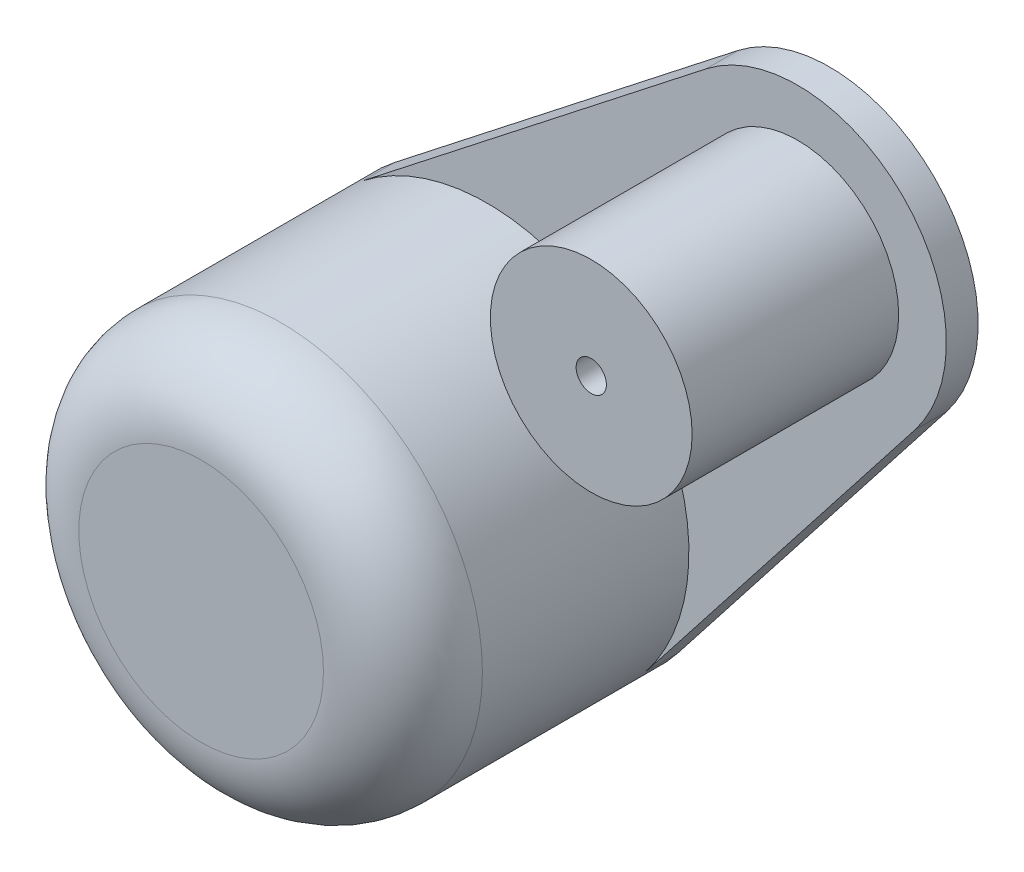
ISO-10303-21;
HEADER;
FILE_DESCRIPTION(('STEP AP214'),'2;1');
FILE_NAME('part.step','',(''),(''),'','','');
FILE_SCHEMA(('AUTOMOTIVE_DESIGN { 1 0 10303 214 1 1 1 1 }'));
ENDSEC;
DATA;
#1=APPLICATION_CONTEXT('core data for automotive mechanical design processes');
#2=APPLICATION_PROTOCOL_DEFINITION('international standard','automotive_design',2000,#1);
#3=PRODUCT_CONTEXT('',#1,'mechanical');
#4=PRODUCT('Part','Part','',(#3));
#5=PRODUCT_RELATED_PRODUCT_CATEGORY('part','',(#4));
#6=PRODUCT_DEFINITION_FORMATION('','',#4);
#7=PRODUCT_DEFINITION_CONTEXT('part definition',#1,'design');
#8=PRODUCT_DEFINITION('design','',#6,#7);
#9=PRODUCT_DEFINITION_SHAPE('','',#8);
#10=(LENGTH_UNIT() NAMED_UNIT(*) SI_UNIT(.MILLI.,.METRE.));
#11=(NAMED_UNIT(*) PLANE_ANGLE_UNIT() SI_UNIT($,.RADIAN.));
#12=(NAMED_UNIT(*) SI_UNIT($,.STERADIAN.) SOLID_ANGLE_UNIT());
#13=UNCERTAINTY_MEASURE_WITH_UNIT(LENGTH_MEASURE(1.E-05),#10,'distance_accuracy_value','');
#14=(GEOMETRIC_REPRESENTATION_CONTEXT(3) GLOBAL_UNCERTAINTY_ASSIGNED_CONTEXT((#13)) GLOBAL_UNIT_ASSIGNED_CONTEXT((#10,
#11,#12)) REPRESENTATION_CONTEXT('',''));
#15=CARTESIAN_POINT('',(0.,0.,0.));
#16=DIRECTION('',(0.,0.,1.));
#17=DIRECTION('',(1.,0.,0.));
#18=AXIS2_PLACEMENT_3D('',#15,#16,#17);
#19=CARTESIAN_POINT('',(0.,0.,20.));
#20=DIRECTION('',(0.,0.,-1.));
#21=DIRECTION('',(-1.,0.,0.));
#22=AXIS2_PLACEMENT_3D('',#19,#20,#21);
#23=CYLINDRICAL_SURFACE('',#22,12.7);
#24=CARTESIAN_POINT('',(0.,0.,2.));
#25=DIRECTION('',(0.,0.,-1.));
#26=DIRECTION('',(1.,0.,0.));
#27=AXIS2_PLACEMENT_3D('',#24,#25,#26);
#28=CIRCLE('',#27,12.7);
#29=CARTESIAN_POINT('',(-7.82607762735875,10.0021252226992,2.));
#30=VERTEX_POINT('',#29);
#31=CARTESIAN_POINT('',(10.0021252226992,-7.82607762735871,2.));
#32=VERTEX_POINT('',#31);
#33=EDGE_CURVE('E51',#30,#32,#28,.T.);
#34=ORIENTED_EDGE('',*,*,#33,.F.);
#35=DIRECTION('',(0.,0.,-1.));
#36=VECTOR('',#35,1.);
#37=CARTESIAN_POINT('',(-7.82607762735876,10.0021252226992,2.));
#38=LINE('',#37,#36);
#39=CARTESIAN_POINT('',(-7.82607762735876,10.0021252226992,0.));
#40=VERTEX_POINT('',#39);
#41=EDGE_CURVE('E92',#30,#40,#38,.T.);
#42=ORIENTED_EDGE('',*,*,#41,.T.);
#43=CARTESIAN_POINT('',(0.,0.,0.));
#44=DIRECTION('',(0.,0.,1.));
#45=DIRECTION('',(1.,0.,0.));
#46=AXIS2_PLACEMENT_3D('',#43,#44,#45);
#47=CIRCLE('',#46,12.7);
#48=CARTESIAN_POINT('',(10.0021252226992,-7.82607762735871,0.));
#49=VERTEX_POINT('',#48);
#50=EDGE_CURVE('E215',#40,#49,#47,.T.);
#51=ORIENTED_EDGE('',*,*,#50,.T.);
#52=DIRECTION('',(0.,0.,-1.));
#53=VECTOR('',#52,1.);
#54=CARTESIAN_POINT('',(10.0021252226992,-7.82607762735871,2.));
#55=LINE('',#54,#53);
#56=EDGE_CURVE('E56',#32,#49,#55,.T.);
#57=ORIENTED_EDGE('',*,*,#56,.F.);
#58=EDGE_LOOP('',(#34,#42,#51,#57));
#59=FACE_BOUND('',#58,.T.);
#60=CARTESIAN_POINT('',(-12.7,0.,3.5743));
#61=CARTESIAN_POINT('',(-12.6999975412651,-0.134937829654794,3.57430510564409));
#62=CARTESIAN_POINT('',(-12.6978272546828,-0.269941563926919,3.58559761218767));
#63=CARTESIAN_POINT('',(-12.6893787781767,-0.536141506911884,3.63043833249237));
#64=CARTESIAN_POINT('',(-12.6830971770619,-0.667334459303385,3.6640050276494));
#65=CARTESIAN_POINT('',(-12.6671284070254,-0.922024794678821,3.75232622953987));
#66=CARTESIAN_POINT('',(-12.6574443656845,-1.04552912285688,3.80706128259899));
#67=CARTESIAN_POINT('',(-12.6357269008548,-1.281590830881,3.93610953592569));
#68=CARTESIAN_POINT('',(-12.6236936537139,-1.39414903147014,4.01042126677758));
#69=CARTESIAN_POINT('',(-12.5984379999736,-1.60653032765749,4.17749170019735));
#70=CARTESIAN_POINT('',(-12.5852038651315,-1.70619801037936,4.27044621206537));
#71=CARTESIAN_POINT('',(-12.559124578173,-1.88862425909244,4.47174243502231));
#72=CARTESIAN_POINT('',(-12.5462794547093,-1.97138158211272,4.58008527621613));
#73=CARTESIAN_POINT('',(-12.5223184219511,-2.11828847818769,4.81018639317911));
#74=CARTESIAN_POINT('',(-12.5112176259588,-2.18227918231144,4.9320478105143));
#75=CARTESIAN_POINT('',(-12.4921677378881,-2.28881915830054,5.18503913005809));
#76=CARTESIAN_POINT('',(-12.4842183632745,-2.33137035237988,5.31616820014916));
#77=CARTESIAN_POINT('',(-12.4724895903282,-2.39332307907379,5.58230710107149));
#78=CARTESIAN_POINT('',(-12.46866132964,-2.41299609868616,5.71725153784289));
#79=CARTESIAN_POINT('',(-12.4654609846437,-2.42947687244775,5.98857592015064));
#80=CARTESIAN_POINT('',(-12.4660884854554,-2.42628675540505,6.12495573085727));
#81=CARTESIAN_POINT('',(-12.4716843021976,-2.39735177688862,6.39330736284632));
#82=CARTESIAN_POINT('',(-12.4765930699839,-2.37191631258743,6.52531397047094));
#83=CARTESIAN_POINT('',(-12.4901047295487,-2.29970021898813,6.78315113878054));
#84=CARTESIAN_POINT('',(-12.498707783652,-2.25291865174775,6.90898142781057));
#85=CARTESIAN_POINT('',(-12.5187005428567,-2.13903769355063,7.15179564152138));
#86=CARTESIAN_POINT('',(-12.5301072118649,-2.07181400242552,7.26871981436208));
#87=CARTESIAN_POINT('',(-12.5544108295071,-1.91904488237926,7.48974485324057));
#88=CARTESIAN_POINT('',(-12.5673079348231,-1.83349752637509,7.59384436870568));
#89=CARTESIAN_POINT('',(-12.5933983059174,-1.64484448878732,7.78805207305613));
#90=CARTESIAN_POINT('',(-12.6065929639091,-1.54147432471869,7.87790335429305));
#91=CARTESIAN_POINT('',(-12.6315979196158,-1.32099330514072,8.03902925018359));
#92=CARTESIAN_POINT('',(-12.6434082024394,-1.20388230185171,8.11030366502055));
#93=CARTESIAN_POINT('',(-12.6643389248778,-0.958971210665557,8.23229310062208));
#94=CARTESIAN_POINT('',(-12.673455769443,-0.831157126154872,8.28298067672987));
#95=CARTESIAN_POINT('',(-12.6879447565521,-0.568615486520746,8.36209398293611));
#96=CARTESIAN_POINT('',(-12.6933173121295,-0.433888695700755,8.39052216851699));
#97=CARTESIAN_POINT('',(-12.6996554298652,-0.163555607041457,8.42395045417244));
#98=CARTESIAN_POINT('',(-12.7006871786224,-0.0279943242078349,8.42930244098042));
#99=CARTESIAN_POINT('',(-12.698410537337,0.242085929176719,8.41737134057863));
#100=CARTESIAN_POINT('',(-12.6951023689107,0.376604952597427,8.40008940916202));
#101=CARTESIAN_POINT('',(-12.6845588739263,0.639660825226353,8.34367354660703));
#102=CARTESIAN_POINT('',(-12.6773556830395,0.768237407939375,8.30471835455176));
#103=CARTESIAN_POINT('',(-12.6598265799459,1.01703427376502,8.20625570688745));
#104=CARTESIAN_POINT('',(-12.6495004495618,1.13725397232018,8.14674681529758));
#105=CARTESIAN_POINT('',(-12.6267058198142,1.36742139182268,8.00809199818586));
#106=CARTESIAN_POINT('',(-12.6142144457891,1.47723779445739,7.92873192200613));
#107=CARTESIAN_POINT('',(-12.588532479696,1.68212090936828,7.75291642366898));
#108=CARTESIAN_POINT('',(-12.5753418197894,1.77718618709175,7.65645934077261));
#109=CARTESIAN_POINT('',(-12.5495274060453,1.9512113743269,7.44759236339294));
#110=CARTESIAN_POINT('',(-12.5369139966128,2.02993074303567,7.33498055991352));
#111=CARTESIAN_POINT('',(-12.5138933590042,2.16733632583265,7.09792533896215));
#112=CARTESIAN_POINT('',(-12.5034860469931,2.22602330123223,6.9734823713518));
#113=CARTESIAN_POINT('',(-12.4861377901906,2.32136060302644,6.71689689860164));
#114=CARTESIAN_POINT('',(-12.479179799118,2.35811948362956,6.58479593474009));
#115=CARTESIAN_POINT('',(-12.4694798071022,2.40889047080517,6.31614693550947));
#116=CARTESIAN_POINT('',(-12.4667373104249,2.42290525205072,6.17959942497459));
#117=CARTESIAN_POINT('',(-12.4658046226152,2.42769809771796,5.90834435725717));
#118=CARTESIAN_POINT('',(-12.4675400622337,2.41885576700201,5.7736436176085));
#119=CARTESIAN_POINT('',(-12.4752024563547,2.37901831371085,5.50768659338038));
#120=CARTESIAN_POINT('',(-12.4811293835419,2.34802333550161,5.37643028635979));
#121=CARTESIAN_POINT('',(-12.4964750851297,2.26492312806993,5.12130244535744));
#122=CARTESIAN_POINT('',(-12.5058868097134,2.21286049951772,4.99741658411341));
#123=CARTESIAN_POINT('',(-12.527146354301,2.08914491990478,4.76007782351743));
#124=CARTESIAN_POINT('',(-12.53899435531,2.01749051312675,4.64662570025529));
#125=CARTESIAN_POINT('',(-12.5640214332587,1.85531200403176,4.43147647066417));
#126=CARTESIAN_POINT('',(-12.5772183199616,1.76451221192284,4.32998921347584));
#127=CARTESIAN_POINT('',(-12.6033244727572,1.56719375571978,4.14356536575212));
#128=CARTESIAN_POINT('',(-12.6162336720906,1.46067148596893,4.05863258207175));
#129=CARTESIAN_POINT('',(-12.6404524322855,1.23373158808032,3.90698075806923));
#130=CARTESIAN_POINT('',(-12.651745822435,1.11319279814332,3.84044036120055));
#131=CARTESIAN_POINT('',(-12.6713022876111,0.862467733836768,3.72866272354056));
#132=CARTESIAN_POINT('',(-12.6795681760311,0.732290552179166,3.68340569340016));
#133=CARTESIAN_POINT('',(-12.690474740536,0.501462388950756,3.62455288669032));
#134=CARTESIAN_POINT('',(-12.6940263412156,0.40215147750796,3.60574063860319));
#135=CARTESIAN_POINT('',(-12.6987898591599,0.201905981870569,3.58061245434132));
#136=CARTESIAN_POINT('',(-12.7000018398251,0.100971441748854,3.57429617954249));
#137=CARTESIAN_POINT('',(-12.7,0.,3.5743));
#138=B_SPLINE_CURVE_WITH_KNOTS('',3,(#60,#61,#62,#63,#64,#65,#66,#67,#68,#69,#70,#71,#72,#73,
#74,#75,#76,#77,#78,#79,#80,#81,#82,#83,#84,#85,#86,#87,#88,#89,#90,#91,#92,#93,#94,#95,#96,#97,
#98,#99,#100,#101,#102,#103,#104,#105,#106,#107,#108,#109,#110,#111,#112,#113,#114,#115,#116,
#117,#118,#119,#120,#121,#122,#123,#124,#125,#126,#127,#128,#129,#130,#131,#132,#133,#134,#135,
#136,#137),.UNSPECIFIED.,.T.,.F.,(4,2,2,2,2,2,2,2,2,2,2,2,2,2,2,2,2,2,2,2,2,2,2,2,2,2,2,2,2,2,2,
2,2,2,2,2,2,2,4),(0.,0.404444196038521,0.809224388832901,1.21363347009597,1.61801220525944,
2.02688445245208,2.43578674239107,2.8480567911605,3.2602898702263,3.66757953473752,
4.07483127661905,4.47650729533418,4.87820096529007,5.28238773991543,5.68661704338256,
6.09746296179598,6.50831329917161,6.91970956425858,7.33106044092057,7.73611597555882,
8.14115082698371,8.54289384227905,8.94466493096315,9.35097275740912,9.75732007271994,
10.169278940084,10.5812221496136,10.9911087515953,11.4009471480139,11.8040229488926,
12.2070961230017,12.6093582878217,13.0116503498361,13.4201881971263,13.8288198809375,
14.241291250516,14.6533783407747,14.9560245324832,15.2586625227743),.UNSPECIFIED.);
#139=CARTESIAN_POINT('',(-12.7,0.,3.5743));
#140=VERTEX_POINT('',#139);
#141=EDGE_CURVE('E122',#140,#140,#138,.T.);
#142=ORIENTED_EDGE('',*,*,#141,.F.);
#143=EDGE_LOOP('',(#142));
#144=FACE_BOUND('',#143,.T.);
#145=CARTESIAN_POINT('',(0.,-12.7,8.4257));
#146=CARTESIAN_POINT('',(-0.134937829654794,-12.6999975412651,8.42569489435592));
#147=CARTESIAN_POINT('',(-0.269941563926919,-12.6978272546828,8.41440238781233));
#148=CARTESIAN_POINT('',(-0.536141506911884,-12.6893787781767,8.36956166750763));
#149=CARTESIAN_POINT('',(-0.667334459303386,-12.6830971770619,8.3359949723506));
#150=CARTESIAN_POINT('',(-0.922024794678821,-12.6671284070254,8.24767377046013));
#151=CARTESIAN_POINT('',(-1.04552912285688,-12.6574443656845,8.19293871740101));
#152=CARTESIAN_POINT('',(-1.281590830881,-12.6357269008548,8.06389046407432));
#153=CARTESIAN_POINT('',(-1.39414903147014,-12.6236936537139,7.98957873322242));
#154=CARTESIAN_POINT('',(-1.60653032765749,-12.5984379999736,7.82250829980265));
#155=CARTESIAN_POINT('',(-1.70619801037936,-12.5852038651315,7.72955378793463));
#156=CARTESIAN_POINT('',(-1.88862425909244,-12.559124578173,7.52825756497769));
#157=CARTESIAN_POINT('',(-1.97138158211272,-12.5462794547093,7.41991472378387));
#158=CARTESIAN_POINT('',(-2.11828847818769,-12.5223184219511,7.18981360682089));
#159=CARTESIAN_POINT('',(-2.18227918231144,-12.5112176259588,7.0679521894857));
#160=CARTESIAN_POINT('',(-2.28881915830054,-12.4921677378881,6.81496086994191));
#161=CARTESIAN_POINT('',(-2.33137035237988,-12.4842183632745,6.68383179985084));
#162=CARTESIAN_POINT('',(-2.39332307907379,-12.4724895903281,6.41769289892851));
#163=CARTESIAN_POINT('',(-2.41299609868616,-12.46866132964,6.28274846215711));
#164=CARTESIAN_POINT('',(-2.42947687244775,-12.4654609846437,6.01142407984936));
#165=CARTESIAN_POINT('',(-2.42628675540505,-12.4660884854554,5.87504426914272));
#166=CARTESIAN_POINT('',(-2.39735177688862,-12.4716843021976,5.60669263715368));
#167=CARTESIAN_POINT('',(-2.37191631258743,-12.4765930699839,5.47468602952906));
#168=CARTESIAN_POINT('',(-2.29970021898813,-12.4901047295487,5.21684886121946));
#169=CARTESIAN_POINT('',(-2.25291865174775,-12.498707783652,5.09101857218943));
#170=CARTESIAN_POINT('',(-2.13903769355063,-12.5187005428567,4.84820435847862));
#171=CARTESIAN_POINT('',(-2.07181400242552,-12.5301072118649,4.73128018563792));
#172=CARTESIAN_POINT('',(-1.91904488237926,-12.5544108295071,4.51025514675943));
#173=CARTESIAN_POINT('',(-1.83349752637509,-12.5673079348231,4.40615563129432));
#174=CARTESIAN_POINT('',(-1.64484448878732,-12.5933983059174,4.21194792694387));
#175=CARTESIAN_POINT('',(-1.54147432471869,-12.6065929639091,4.12209664570695));
#176=CARTESIAN_POINT('',(-1.32099330514072,-12.6315979196158,3.96097074981641));
#177=CARTESIAN_POINT('',(-1.20388230185171,-12.6434082024394,3.88969633497945));
#178=CARTESIAN_POINT('',(-0.958971210665557,-12.6643389248778,3.76770689937792));
#179=CARTESIAN_POINT('',(-0.831157126154872,-12.673455769443,3.71701932327013));
#180=CARTESIAN_POINT('',(-0.568615486520746,-12.6879447565521,3.63790601706389));
#181=CARTESIAN_POINT('',(-0.433888695700755,-12.6933173121295,3.60947783148301));
#182=CARTESIAN_POINT('',(-0.163555607041457,-12.6996554298652,3.57604954582756));
#183=CARTESIAN_POINT('',(-0.0279943242078349,-12.7006871786224,3.57069755901958));
#184=CARTESIAN_POINT('',(0.242085929176719,-12.698410537337,3.58262865942137));
#185=CARTESIAN_POINT('',(0.376604952597427,-12.6951023689107,3.59991059083798));
#186=CARTESIAN_POINT('',(0.639660825226353,-12.6845588739263,3.65632645339297));
#187=CARTESIAN_POINT('',(0.768237407939375,-12.6773556830395,3.69528164544824));
#188=CARTESIAN_POINT('',(1.01703427376503,-12.6598265799459,3.79374429311255));
#189=CARTESIAN_POINT('',(1.13725397232018,-12.6495004495618,3.85325318470242));
#190=CARTESIAN_POINT('',(1.36742139182268,-12.6267058198142,3.99190800181414));
#191=CARTESIAN_POINT('',(1.47723779445739,-12.6142144457891,4.07126807799387));
#192=CARTESIAN_POINT('',(1.68212090936828,-12.588532479696,4.24708357633102));
#193=CARTESIAN_POINT('',(1.77718618709175,-12.5753418197894,4.34354065922739));
#194=CARTESIAN_POINT('',(1.9512113743269,-12.5495274060453,4.55240763660706));
#195=CARTESIAN_POINT('',(2.02993074303567,-12.5369139966128,4.66501944008648));
#196=CARTESIAN_POINT('',(2.16733632583265,-12.5138933590042,4.90207466103785));
#197=CARTESIAN_POINT('',(2.22602330123223,-12.5034860469931,5.0265176286482));
#198=CARTESIAN_POINT('',(2.32136060302644,-12.4861377901906,5.28310310139836));
#199=CARTESIAN_POINT('',(2.35811948362956,-12.479179799118,5.41520406525991));
#200=CARTESIAN_POINT('',(2.40889047080517,-12.4694798071022,5.68385306449053));
#201=CARTESIAN_POINT('',(2.42290525205072,-12.4667373104249,5.82040057502541));
#202=CARTESIAN_POINT('',(2.42769809771796,-12.4658046226152,6.09165564274283));
#203=CARTESIAN_POINT('',(2.41885576700201,-12.4675400622337,6.2263563823915));
#204=CARTESIAN_POINT('',(2.37901831371085,-12.4752024563547,6.49231340661962));
#205=CARTESIAN_POINT('',(2.34802333550161,-12.4811293835419,6.62356971364021));
#206=CARTESIAN_POINT('',(2.26492312806993,-12.4964750851297,6.87869755464256));
#207=CARTESIAN_POINT('',(2.21286049951772,-12.5058868097134,7.00258341588659));
#208=CARTESIAN_POINT('',(2.08914491990478,-12.527146354301,7.23992217648257));
#209=CARTESIAN_POINT('',(2.01749051312675,-12.53899435531,7.35337429974471));
#210=CARTESIAN_POINT('',(1.85531200403176,-12.5640214332587,7.56852352933583));
#211=CARTESIAN_POINT('',(1.76451221192284,-12.5772183199616,7.67001078652416));
#212=CARTESIAN_POINT('',(1.56719375571978,-12.6033244727572,7.85643463424788));
#213=CARTESIAN_POINT('',(1.46067148596893,-12.6162336720906,7.94136741792825));
#214=CARTESIAN_POINT('',(1.23373158808032,-12.6404524322855,8.09301924193077));
#215=CARTESIAN_POINT('',(1.11319279814332,-12.651745822435,8.15955963879945));
#216=CARTESIAN_POINT('',(0.862467733836769,-12.6713022876111,8.27133727645944));
#217=CARTESIAN_POINT('',(0.732290552179167,-12.6795681760311,8.31659430659984));
#218=CARTESIAN_POINT('',(0.501462388950756,-12.690474740536,8.37544711330968));
#219=CARTESIAN_POINT('',(0.40215147750796,-12.6940263412156,8.39425936139681));
#220=CARTESIAN_POINT('',(0.201905981870568,-12.6987898591599,8.41938754565868));
#221=CARTESIAN_POINT('',(0.100971441748854,-12.7000018398251,8.42570382045751));
#222=CARTESIAN_POINT('',(0.,-12.7,8.4257));
#223=B_SPLINE_CURVE_WITH_KNOTS('',3,(#145,#146,#147,#148,#149,#150,#151,#152,#153,#154,#155,
#156,#157,#158,#159,#160,#161,#162,#163,#164,#165,#166,#167,#168,#169,#170,#171,#172,#173,#174,
#175,#176,#177,#178,#179,#180,#181,#182,#183,#184,#185,#186,#187,#188,#189,#190,#191,#192,#193,
#194,#195,#196,#197,#198,#199,#200,#201,#202,#203,#204,#205,#206,#207,#208,#209,#210,#211,#212,
#213,#214,#215,#216,#217,#218,#219,#220,#221,#222),.UNSPECIFIED.,.T.,.F.,(4,2,2,2,2,2,2,2,2,2,2,
2,2,2,2,2,2,2,2,2,2,2,2,2,2,2,2,2,2,2,2,2,2,2,2,2,2,2,4),(0.,0.404444196038521,
0.809224388832901,1.21363347009597,1.61801220525944,2.02688445245208,2.43578674239107,
2.84805679116051,3.2602898702263,3.66757953473752,4.07483127661905,4.47650729533418,
4.87820096529007,5.28238773991544,5.68661704338257,6.09746296179598,6.50831329917161,
6.91970956425858,7.33106044092057,7.73611597555882,8.14115082698371,8.54289384227906,
8.94466493096315,9.35097275740912,9.75732007271994,10.169278940084,10.5812221496136,
10.9911087515953,11.4009471480139,11.8040229488926,12.2070961230017,12.6093582878217,
13.0116503498361,13.4201881971264,13.8288198809375,14.241291250516,14.6533783407747,
14.9560245324832,15.2586625227743),.UNSPECIFIED.);
#224=CARTESIAN_POINT('',(0.,-12.7,8.4257));
#225=VERTEX_POINT('',#224);
#226=EDGE_CURVE('E203',#225,#225,#223,.T.);
#227=ORIENTED_EDGE('',*,*,#226,.F.);
#228=EDGE_LOOP('',(#227));
#229=FACE_BOUND('',#228,.T.);
#230=CARTESIAN_POINT('',(0.,0.,15.));
#231=DIRECTION('',(0.,0.,1.));
#232=DIRECTION('',(1.,0.,0.));
#233=AXIS2_PLACEMENT_3D('',#230,#231,#232);
#234=CIRCLE('',#233,12.7);
#235=CARTESIAN_POINT('',(12.7,0.,15.));
#236=VERTEX_POINT('',#235);
#237=EDGE_CURVE('E12',#236,#236,#234,.F.);
#238=ORIENTED_EDGE('',*,*,#237,.T.);
#239=EDGE_LOOP('',(#238));
#240=FACE_BOUND('',#239,.T.);
#241=ADVANCED_FACE('F35',(#59,#144,#229,#240),#23,.T.);
#242=CARTESIAN_POINT('',(0.,0.,20.));
#243=DIRECTION('',(0.,0.,1.));
#244=DIRECTION('',(1.,0.,0.));
#245=AXIS2_PLACEMENT_3D('',#242,#243,#244);
#246=PLANE('',#245);
#247=CARTESIAN_POINT('',(0.,0.,20.));
#248=DIRECTION('',(0.,0.,1.));
#249=DIRECTION('',(1.,0.,0.));
#250=AXIS2_PLACEMENT_3D('',#247,#248,#249);
#251=CIRCLE('',#250,7.7);
#252=CARTESIAN_POINT('',(7.7,0.,20.));
#253=VERTEX_POINT('',#252);
#254=EDGE_CURVE('E44',#253,#253,#251,.T.);
#255=ORIENTED_EDGE('',*,*,#254,.T.);
#256=EDGE_LOOP('',(#255));
#257=FACE_BOUND('',#256,.T.);
#258=ADVANCED_FACE('F169',(#257),#246,.T.);
#259=CARTESIAN_POINT('',(0.,0.,0.));
#260=DIRECTION('',(0.,0.,1.));
#261=DIRECTION('',(1.,0.,0.));
#262=AXIS2_PLACEMENT_3D('',#259,#260,#261);
#263=PLANE('',#262);
#264=CARTESIAN_POINT('',(19.551502499808,19.5515024998081,0.));
#265=DIRECTION('',(0.,0.,1.));
#266=DIRECTION('',(1.,0.,0.));
#267=AXIS2_PLACEMENT_3D('',#264,#265,#266);
#268=CIRCLE('',#267,3.);
#269=CARTESIAN_POINT('',(22.551502499808,19.5515024998081,0.));
#270=VERTEX_POINT('',#269);
#271=EDGE_CURVE('E356',#270,#270,#268,.T.);
#272=ORIENTED_EDGE('',*,*,#271,.T.);
#273=EDGE_LOOP('',(#272));
#274=FACE_BOUND('',#273,.T.);
#275=CARTESIAN_POINT('',(0.,0.,0.));
#276=DIRECTION('',(0.,0.,-1.));
#277=DIRECTION('',(-1.,0.,0.));
#278=AXIS2_PLACEMENT_3D('',#275,#276,#277);
#279=CIRCLE('',#278,3.175);
#280=CARTESIAN_POINT('',(-3.175,0.,0.));
#281=VERTEX_POINT('',#280);
#282=EDGE_CURVE('E209',#281,#281,#279,.T.);
#283=ORIENTED_EDGE('',*,*,#282,.F.);
#284=EDGE_LOOP('',(#283));
#285=FACE_BOUND('',#284,.T.);
#286=ORIENTED_EDGE('',*,*,#50,.F.);
#287=DIRECTION('',(-0.787568915173163,-0.616226584831398,0.));
#288=VECTOR('',#287,1.);
#289=CARTESIAN_POINT('',(13.7897839316344,26.9152718566771,0.));
#290=LINE('',#289,#288);
#291=CARTESIAN_POINT('',(13.7897839316344,26.9152718566771,0.));
#292=VERTEX_POINT('',#291);
#293=EDGE_CURVE('E341',#292,#40,#290,.T.);
#294=ORIENTED_EDGE('',*,*,#293,.F.);
#295=CARTESIAN_POINT('',(19.551502499808,19.5515024998081,0.));
#296=DIRECTION('',(0.,0.,1.));
#297=DIRECTION('',(1.,0.,0.));
#298=AXIS2_PLACEMENT_3D('',#295,#296,#297);
#299=CIRCLE('',#298,9.35);
#300=CARTESIAN_POINT('',(26.9152718566771,13.7897839316345,0.));
#301=VERTEX_POINT('',#300);
#302=EDGE_CURVE('E107',#301,#292,#299,.T.);
#303=ORIENTED_EDGE('',*,*,#302,.F.);
#304=DIRECTION('',(0.616226584831395,0.787568915173165,0.));
#305=VECTOR('',#304,1.);
#306=CARTESIAN_POINT('',(26.9152718566771,13.7897839316345,0.));
#307=LINE('',#306,#305);
#308=EDGE_CURVE('E103',#49,#301,#307,.T.);
#309=ORIENTED_EDGE('',*,*,#308,.F.);
#310=EDGE_LOOP('',(#286,#294,#303,#309));
#311=FACE_BOUND('',#310,.T.);
#312=ADVANCED_FACE('F175',(#274,#285,#311),#263,.F.);
#313=CARTESIAN_POINT('',(0.,0.,17.175));
#314=DIRECTION('',(0.,0.,-1.));
#315=DIRECTION('',(-1.,0.,0.));
#316=AXIS2_PLACEMENT_3D('',#313,#314,#315);
#317=CONICAL_SURFACE('',#316,0.,0.78539816339745);
#318=CARTESIAN_POINT('',(0.,0.,14.));
#319=DIRECTION('',(0.,0.,-1.));
#320=DIRECTION('',(-1.,0.,0.));
#321=AXIS2_PLACEMENT_3D('',#318,#319,#320);
#322=CIRCLE('',#321,3.175);
#323=CARTESIAN_POINT('',(-3.175,0.,14.));
#324=VERTEX_POINT('',#323);
#325=EDGE_CURVE('E212',#324,#324,#322,.T.);
#326=ORIENTED_EDGE('',*,*,#325,.T.);
#327=EDGE_LOOP('',(#326));
#328=FACE_BOUND('',#327,.T.);
#329=CARTESIAN_POINT('',(0.,0.,17.175));
#330=VERTEX_POINT('',#329);
#331=VERTEX_LOOP('',#330);
#332=FACE_BOUND('',#331,.T.);
#333=ADVANCED_FACE('F181',(#328,#332),#317,.F.);
#334=CARTESIAN_POINT('',(0.,0.,-0.999999999999999));
#335=DIRECTION('',(0.,0.,-1.));
#336=DIRECTION('',(-1.,0.,0.));
#337=AXIS2_PLACEMENT_3D('',#334,#335,#336);
#338=CYLINDRICAL_SURFACE('',#337,3.175);
#339=CARTESIAN_POINT('',(-3.175,0.,3.5743));
#340=CARTESIAN_POINT('',(-3.17499062791092,-0.117923113005601,3.57430972112859));
#341=CARTESIAN_POINT('',(-3.16836409145182,-0.235981887128341,3.58296588690723));
#342=CARTESIAN_POINT('',(-3.14245650225448,-0.468321779368559,3.61703010247815));
#343=CARTESIAN_POINT('',(-3.12315216473735,-0.582595539260479,3.64246897675113));
#344=CARTESIAN_POINT('',(-3.07373601388625,-0.803433778967608,3.70833699823245));
#345=CARTESIAN_POINT('',(-3.04368817503777,-0.910039499371546,3.74867745690598));
#346=CARTESIAN_POINT('',(-2.97501664233619,-1.11423625227187,3.84242362869098));
#347=CARTESIAN_POINT('',(-2.93639391319682,-1.21182829709975,3.89582787213666));
#348=CARTESIAN_POINT('',(-2.84906554055773,-1.40562246623216,4.01942731634925));
#349=CARTESIAN_POINT('',(-2.79975502430636,-1.50084303701004,4.09072505106632));
#350=CARTESIAN_POINT('',(-2.6968537502738,-1.67874687913493,4.24508472698257));
#351=CARTESIAN_POINT('',(-2.64325675930596,-1.76141136674183,4.32816394103044));
#352=CARTESIAN_POINT('',(-2.52372555255862,-1.9298175307784,4.52357798593524));
#353=CARTESIAN_POINT('',(-2.45757057332428,-2.01253995855879,4.63838912060325));
#354=CARTESIAN_POINT('',(-2.33095365892699,-2.15789596577647,4.88299307281368));
#355=CARTESIAN_POINT('',(-2.27048480706396,-2.22055418091625,5.01276724960189));
#356=CARTESIAN_POINT('',(-2.18390655169721,-2.30509795431771,5.23873752700924));
#357=CARTESIAN_POINT('',(-2.15319398082653,-2.3335722799048,5.33068043078241));
#358=CARTESIAN_POINT('',(-2.10210035974789,-2.3797036562465,5.51992318071008));
#359=CARTESIAN_POINT('',(-2.0816951678243,-2.39738600417099,5.61720991196618));
#360=CARTESIAN_POINT('',(-2.05441719806921,-2.42081647695892,5.81621510050969));
#361=CARTESIAN_POINT('',(-2.04768354992273,-2.42644193558056,5.91796845952123));
#362=CARTESIAN_POINT('',(-2.04962717047703,-2.42479964363562,6.12123740947197));
#363=CARTESIAN_POINT('',(-2.05830697165608,-2.41752977432626,6.2227529585941));
#364=CARTESIAN_POINT('',(-2.08736271629394,-2.39245333183205,6.40992378717254));
#365=CARTESIAN_POINT('',(-2.1062107732976,-2.37601527901591,6.49602086967921));
#366=CARTESIAN_POINT('',(-2.15194836514533,-2.33467264915915,6.66393655155022));
#367=CARTESIAN_POINT('',(-2.17884633544122,-2.30975918702941,6.74575055651867));
#368=CARTESIAN_POINT('',(-2.25735589540861,-2.2337290834814,6.95595687435291));
#369=CARTESIAN_POINT('',(-2.31369442308332,-2.17608980390456,7.08021941405517));
#370=CARTESIAN_POINT('',(-2.43241789147821,-2.04254956705997,7.31543583104093));
#371=CARTESIAN_POINT('',(-2.49481780531211,-1.96660266344534,7.42635515417717));
#372=CARTESIAN_POINT('',(-2.62123006647171,-1.79485519911505,7.63755282678239));
#373=CARTESIAN_POINT('',(-2.68523358381112,-1.69852001741512,7.73740374794208));
#374=CARTESIAN_POINT('',(-2.80725719771103,-1.48817813907476,7.92060623166929));
#375=CARTESIAN_POINT('',(-2.8652880685352,-1.37420422603296,8.00398776296745));
#376=CARTESIAN_POINT('',(-2.96035642229414,-1.15264882538752,8.13748756558574));
#377=CARTESIAN_POINT('',(-2.99928985967042,-1.04788302068027,8.19091171691571));
#378=CARTESIAN_POINT('',(-3.06703527760473,-0.828869324362796,8.28277609368681));
#379=CARTESIAN_POINT('',(-3.095853142769,-0.71462699358702,8.3212250322001));
#380=CARTESIAN_POINT('',(-3.14105399510049,-0.478473910697923,8.38117782669817));
#381=CARTESIAN_POINT('',(-3.15735110524156,-0.356516301930848,8.40256469551403));
#382=CARTESIAN_POINT('',(-3.175510075859,-0.109712503686234,8.42638060269421));
#383=CARTESIAN_POINT('',(-3.1773801628803,0.0151319988892502,8.42882044499496));
#384=CARTESIAN_POINT('',(-3.16713305025796,0.249132505134568,8.41539588018691));
#385=CARTESIAN_POINT('',(-3.15655620097001,0.358482069901307,8.40154732180297));
#386=CARTESIAN_POINT('',(-3.12478225920179,0.572800459979568,8.35962845850002));
#387=CARTESIAN_POINT('',(-3.10358324084723,0.677768487147356,8.33155557459994));
#388=CARTESIAN_POINT('',(-3.05155172680765,0.883263092171549,8.26183845056111));
#389=CARTESIAN_POINT('',(-3.02051472300965,0.983638191247997,8.21990521244357));
#390=CARTESIAN_POINT('',(-2.95101781360569,1.17582914319638,8.12437640784784));
#391=CARTESIAN_POINT('',(-2.91255674104709,1.26764364710154,8.07077900776874));
#392=CARTESIAN_POINT('',(-2.82364012694614,1.45610226037011,7.94389228601711));
#393=CARTESIAN_POINT('',(-2.77225130329455,1.55109677416068,7.86881744081474));
#394=CARTESIAN_POINT('',(-2.66558583754616,1.72799261854982,7.70660628606977));
#395=CARTESIAN_POINT('',(-2.61030184231475,1.80986817561807,7.61944684651889));
#396=CARTESIAN_POINT('',(-2.52168011794049,1.93000195162782,7.47113802169935));
#397=CARTESIAN_POINT('',(-2.48837273926921,1.97264287089076,7.41345828878924));
#398=CARTESIAN_POINT('',(-2.42260430837435,2.0528762803618,7.29417490729775));
#399=CARTESIAN_POINT('',(-2.39014355714559,2.09046699430625,7.23256988928397));
#400=CARTESIAN_POINT('',(-2.32721135035053,2.16030501605236,7.10559590814503));
#401=CARTESIAN_POINT('',(-2.29673637368973,2.19256194687582,7.04023401672611));
#402=CARTESIAN_POINT('',(-2.23901171710503,2.2514777985706,6.90568291400658));
#403=CARTESIAN_POINT('',(-2.21176111238076,2.27813832628444,6.83649480851904));
#404=CARTESIAN_POINT('',(-2.15610104962051,2.33102070783651,6.67745642252278));
#405=CARTESIAN_POINT('',(-2.12895416180725,2.35563378528016,6.58660223516156));
#406=CARTESIAN_POINT('',(-2.08535753529331,2.39432166998785,6.40031482574843));
#407=CARTESIAN_POINT('',(-2.06888192489176,2.40842197731274,6.30489328526051));
#408=CARTESIAN_POINT('',(-2.04927804558307,2.42513352532489,6.11082699601395));
#409=CARTESIAN_POINT('',(-2.0462566789692,2.42765275224749,6.01216268504799));
#410=CARTESIAN_POINT('',(-2.05447556206225,2.42069697422038,5.81582881977167));
#411=CARTESIAN_POINT('',(-2.06572772611827,2.41121194914073,5.71816016518263));
#412=CARTESIAN_POINT('',(-2.10277025821796,2.37899979153523,5.51363536781546));
#413=CARTESIAN_POINT('',(-2.13035877427235,2.35462015434635,5.40738096437983));
#414=CARTESIAN_POINT('',(-2.19630986072568,2.2932221899428,5.20206382885723));
#415=CARTESIAN_POINT('',(-2.23470063752677,2.25617071925777,5.10302079064207));
#416=CARTESIAN_POINT('',(-2.33446326402296,2.15356846936115,4.87408864509337));
#417=CARTESIAN_POINT('',(-2.39884173291072,2.0825535273504,4.74797470582121));
#418=CARTESIAN_POINT('',(-2.53054767046851,1.92039791531855,4.51113826135111));
#419=CARTESIAN_POINT('',(-2.59787868703302,1.82923246922294,4.4004349798426));
#420=CARTESIAN_POINT('',(-2.72996022217753,1.62571149183851,4.19376846454092));
#421=CARTESIAN_POINT('',(-2.79464406629102,1.51300979927907,4.09810045662902));
#422=CARTESIAN_POINT('',(-2.91375675028651,1.26847551162367,3.92705087608834));
#423=CARTESIAN_POINT('',(-2.96820842671484,1.13668670950317,3.85162396345067));
#424=CARTESIAN_POINT('',(-3.04812518500703,0.895020055650541,3.74269751328269));
#425=CARTESIAN_POINT('',(-3.07744464939723,0.789028649090939,3.70337267510723));
#426=CARTESIAN_POINT('',(-3.12532200463322,0.570451475710216,3.63960079758821));
#427=CARTESIAN_POINT('',(-3.14390525041034,0.457881942678077,3.61511869843316));
#428=CARTESIAN_POINT('',(-3.16252676648206,0.286918581124175,3.59064456696189));
#429=CARTESIAN_POINT('',(-3.16719123397574,0.229823626433761,3.58452841482152));
#430=CARTESIAN_POINT('',(-3.17343050338122,0.11516330773924,3.57635327952669));
#431=CARTESIAN_POINT('',(-3.17500457766113,0.0575978361551066,3.57429525185557));
#432=CARTESIAN_POINT('',(-3.175,0.,3.5743));
#433=B_SPLINE_CURVE_WITH_KNOTS('',3,(#339,#340,#341,#342,#343,#344,#345,#346,#347,#348,#349,
#350,#351,#352,#353,#354,#355,#356,#357,#358,#359,#360,#361,#362,#363,#364,#365,#366,#367,#368,
#369,#370,#371,#372,#373,#374,#375,#376,#377,#378,#379,#380,#381,#382,#383,#384,#385,#386,#387,
#388,#389,#390,#391,#392,#393,#394,#395,#396,#397,#398,#399,#400,#401,#402,#403,#404,#405,#406,
#407,#408,#409,#410,#411,#412,#413,#414,#415,#416,#417,#418,#419,#420,#421,#422,#423,#424,#425,
#426,#427,#428,#429,#430,#431,#432),.UNSPECIFIED.,.T.,.F.,(4,2,2,2,2,2,2,2,2,2,2,2,2,2,2,2,2,2,
2,2,2,2,2,2,2,2,2,2,2,2,2,2,2,2,2,2,2,2,2,2,2,2,2,2,2,2,4),(0.,0.353523009507626,
0.70769714243893,1.05979646419341,1.41185619324576,1.79680520673449,2.18232454431365,
2.64904566445993,3.11519150724119,3.4173093685751,3.7187162964302,4.02317544796958,
4.32768462773498,4.59566684432237,4.86393086689239,5.30584248739169,5.74887492923747,
6.20541212025936,6.66111075539312,7.03127359011731,7.40122072901899,7.77368314268485,
8.14593315595504,8.47656708892028,8.80726098985619,9.14533787734809,9.48346794881013,
9.87667820892736,10.2706517419094,10.507685370816,10.7448021523944,10.981486354973,
11.2181025074118,11.5109289170834,11.8030427073488,12.0974734280878,12.3921500767553,
12.7276510153605,13.0640362616356,13.5368092541659,14.0101668112792,14.4918937852322,
14.972532509971,15.321515694346,15.6696713060773,15.8423038570677,16.014977049453),.UNSPECIFIED.);
#434=CARTESIAN_POINT('',(-2.24506403026732,-2.24506403026726,6.91853578591147));
#435=VERTEX_POINT('',#434);
#436=CARTESIAN_POINT('',(-2.24506403026763,-2.24506403026695,5.08146421408853));
#437=VERTEX_POINT('',#436);
#438=EDGE_CURVE('E110',#435,#437,#433,.T.);
#439=ORIENTED_EDGE('',*,*,#438,.T.);
#440=CARTESIAN_POINT('',(0.,-3.175,8.4257));
#441=CARTESIAN_POINT('',(-0.117923113005601,-3.17499062791092,8.42569027887141));
#442=CARTESIAN_POINT('',(-0.235981887128341,-3.16836409145182,8.41703411309277));
#443=CARTESIAN_POINT('',(-0.468321779368559,-3.14245650225448,8.38296989752185));
#444=CARTESIAN_POINT('',(-0.582595539260479,-3.12315216473735,8.35753102324887));
#445=CARTESIAN_POINT('',(-0.803433778967609,-3.07373601388625,8.29166300176755));
#446=CARTESIAN_POINT('',(-0.910039499371547,-3.04368817503777,8.25132254309402));
#447=CARTESIAN_POINT('',(-1.11423625227187,-2.97501664233619,8.15757637130902));
#448=CARTESIAN_POINT('',(-1.21182829709975,-2.93639391319682,8.10417212786334));
#449=CARTESIAN_POINT('',(-1.40562246623216,-2.84906554055773,7.98057268365075));
#450=CARTESIAN_POINT('',(-1.50084303701005,-2.79975502430636,7.90927494893368));
#451=CARTESIAN_POINT('',(-1.67874687913493,-2.6968537502738,7.75491527301743));
#452=CARTESIAN_POINT('',(-1.76141136674183,-2.64325675930596,7.67183605896956));
#453=CARTESIAN_POINT('',(-1.9298175307784,-2.52372555255862,7.47642201406476));
#454=CARTESIAN_POINT('',(-2.01253995855879,-2.45757057332428,7.36161087939675));
#455=CARTESIAN_POINT('',(-2.15789596577647,-2.33095365892699,7.11700692718632));
#456=CARTESIAN_POINT('',(-2.22055418091625,-2.27048480706396,6.98723275039811));
#457=CARTESIAN_POINT('',(-2.30509795431771,-2.18390655169721,6.76126247299076));
#458=CARTESIAN_POINT('',(-2.3335722799048,-2.15319398082652,6.66931956921759));
#459=CARTESIAN_POINT('',(-2.3797036562465,-2.10210035974789,6.48007681928992));
#460=CARTESIAN_POINT('',(-2.39738600417099,-2.0816951678243,6.38279008803382));
#461=CARTESIAN_POINT('',(-2.42081647695892,-2.05441719806921,6.18378489949031));
#462=CARTESIAN_POINT('',(-2.42644193558056,-2.04768354992273,6.08203154047876));
#463=CARTESIAN_POINT('',(-2.42479964363562,-2.04962717047703,5.87876259052803));
#464=CARTESIAN_POINT('',(-2.41752977432626,-2.05830697165608,5.7772470414059));
#465=CARTESIAN_POINT('',(-2.39245333183205,-2.08736271629394,5.59007621282746));
#466=CARTESIAN_POINT('',(-2.37601527901591,-2.1062107732976,5.50397913032079));
#467=CARTESIAN_POINT('',(-2.33467264915915,-2.15194836514533,5.33606344844978));
#468=CARTESIAN_POINT('',(-2.30975918702941,-2.17884633544122,5.25424944348133));
#469=CARTESIAN_POINT('',(-2.2337290834814,-2.25735589540861,5.04404312564709));
#470=CARTESIAN_POINT('',(-2.17608980390456,-2.31369442308332,4.91978058594483));
#471=CARTESIAN_POINT('',(-2.04254956705997,-2.43241789147821,4.68456416895907));
#472=CARTESIAN_POINT('',(-1.96660266344534,-2.49481780531211,4.57364484582283));
#473=CARTESIAN_POINT('',(-1.79485519911505,-2.62123006647171,4.36244717321761));
#474=CARTESIAN_POINT('',(-1.69852001741512,-2.68523358381112,4.26259625205792));
#475=CARTESIAN_POINT('',(-1.48817813907476,-2.80725719771103,4.07939376833071));
#476=CARTESIAN_POINT('',(-1.37420422603296,-2.8652880685352,3.99601223703255));
#477=CARTESIAN_POINT('',(-1.15264882538752,-2.96035642229414,3.86251243441426));
#478=CARTESIAN_POINT('',(-1.04788302068027,-2.99928985967041,3.80908828308429));
#479=CARTESIAN_POINT('',(-0.8288693243628,-3.06703527760473,3.71722390631319));
#480=CARTESIAN_POINT('',(-0.714626993587024,-3.095853142769,3.6787749677999));
#481=CARTESIAN_POINT('',(-0.478473910697926,-3.14105399510049,3.61882217330183));
#482=CARTESIAN_POINT('',(-0.356516301930851,-3.15735110524156,3.59743530448597));
#483=CARTESIAN_POINT('',(-0.109712503686238,-3.175510075859,3.57361939730579));
#484=CARTESIAN_POINT('',(0.0151319988892465,-3.1773801628803,3.57117955500504));
#485=CARTESIAN_POINT('',(0.249132505134564,-3.16713305025796,3.58460411981309));
#486=CARTESIAN_POINT('',(0.358482069901303,-3.15655620097001,3.59845267819703));
#487=CARTESIAN_POINT('',(0.572800459979563,-3.12478225920179,3.64037154149997));
#488=CARTESIAN_POINT('',(0.677768487147352,-3.10358324084723,3.66844442540006));
#489=CARTESIAN_POINT('',(0.883263092171547,-3.05155172680765,3.73816154943889));
#490=CARTESIAN_POINT('',(0.983638191247996,-3.02051472300965,3.78009478755643));
#491=CARTESIAN_POINT('',(1.17582914319638,-2.95101781360569,3.87562359215216));
#492=CARTESIAN_POINT('',(1.26764364710154,-2.91255674104709,3.92922099223126));
#493=CARTESIAN_POINT('',(1.4561022603701,-2.82364012694614,4.05610771398289));
#494=CARTESIAN_POINT('',(1.55109677416068,-2.77225130329455,4.13118255918525));
#495=CARTESIAN_POINT('',(1.72799261854982,-2.66558583754616,4.29339371393023));
#496=CARTESIAN_POINT('',(1.80986817561807,-2.61030184231475,4.38055315348111));
#497=CARTESIAN_POINT('',(1.93000195162782,-2.52168011794049,4.52886197830065));
#498=CARTESIAN_POINT('',(1.97264287089076,-2.48837273926921,4.58654171121076));
#499=CARTESIAN_POINT('',(2.0528762803618,-2.42260430837435,4.70582509270225));
#500=CARTESIAN_POINT('',(2.09046699430625,-2.39014355714559,4.76743011071603));
#501=CARTESIAN_POINT('',(2.16030501605236,-2.32721135035053,4.89440409185496));
#502=CARTESIAN_POINT('',(2.19256194687582,-2.29673637368973,4.95976598327389));
#503=CARTESIAN_POINT('',(2.2514777985706,-2.23901171710503,5.09431708599342));
#504=CARTESIAN_POINT('',(2.27813832628444,-2.21176111238077,5.16350519148096));
#505=CARTESIAN_POINT('',(2.33102070783651,-2.15610104962051,5.32254357747722));
#506=CARTESIAN_POINT('',(2.35563378528016,-2.12895416180725,5.41339776483844));
#507=CARTESIAN_POINT('',(2.39432166998785,-2.08535753529331,5.59968517425157));
#508=CARTESIAN_POINT('',(2.40842197731274,-2.06888192489176,5.69510671473949));
#509=CARTESIAN_POINT('',(2.42513352532489,-2.04927804558307,5.88917300398604));
#510=CARTESIAN_POINT('',(2.42765275224749,-2.0462566789692,5.98783731495201));
#511=CARTESIAN_POINT('',(2.42069697422038,-2.05447556206225,6.18417118022832));
#512=CARTESIAN_POINT('',(2.41121194914073,-2.06572772611827,6.28183983481737));
#513=CARTESIAN_POINT('',(2.37899979153523,-2.10277025821796,6.48636463218454));
#514=CARTESIAN_POINT('',(2.35462015434635,-2.13035877427235,6.59261903562016));
#515=CARTESIAN_POINT('',(2.2932221899428,-2.19630986072568,6.79793617114276));
#516=CARTESIAN_POINT('',(2.25617071925777,-2.23470063752677,6.89697920935793));
#517=CARTESIAN_POINT('',(2.15356846936115,-2.33446326402296,7.12591135490663));
#518=CARTESIAN_POINT('',(2.0825535273504,-2.39884173291072,7.25202529417878));
#519=CARTESIAN_POINT('',(1.92039791531856,-2.53054767046851,7.48886173864888));
#520=CARTESIAN_POINT('',(1.82923246922294,-2.59787868703302,7.59956502015739));
#521=CARTESIAN_POINT('',(1.62571149183852,-2.72996022217752,7.80623153545907));
#522=CARTESIAN_POINT('',(1.51300979927907,-2.79464406629101,7.90189954337098));
#523=CARTESIAN_POINT('',(1.26847551162368,-2.91375675028651,8.07294912391166));
#524=CARTESIAN_POINT('',(1.13668670950318,-2.96820842671483,8.14837603654933));
#525=CARTESIAN_POINT('',(0.895020055650548,-3.04812518500702,8.25730248671731));
#526=CARTESIAN_POINT('',(0.789028649090946,-3.07744464939722,8.29662732489277));
#527=CARTESIAN_POINT('',(0.570451475710223,-3.12532200463322,8.36039920241179));
#528=CARTESIAN_POINT('',(0.457881942678084,-3.14390525041034,8.38488130156683));
#529=CARTESIAN_POINT('',(0.28691858112418,-3.16252676648206,8.40935543303811));
#530=CARTESIAN_POINT('',(0.229823626433765,-3.16719123397574,8.41547158517848));
#531=CARTESIAN_POINT('',(0.115163307739242,-3.17343050338122,8.42364672047331));
#532=CARTESIAN_POINT('',(0.0575978361551077,-3.17500457766113,8.42570474814443));
#533=CARTESIAN_POINT('',(0.,-3.175,8.4257));
#534=B_SPLINE_CURVE_WITH_KNOTS('',3,(#440,#441,#442,#443,#444,#445,#446,#447,#448,#449,#450,
#451,#452,#453,#454,#455,#456,#457,#458,#459,#460,#461,#462,#463,#464,#465,#466,#467,#468,#469,
#470,#471,#472,#473,#474,#475,#476,#477,#478,#479,#480,#481,#482,#483,#484,#485,#486,#487,#488,
#489,#490,#491,#492,#493,#494,#495,#496,#497,#498,#499,#500,#501,#502,#503,#504,#505,#506,#507,
#508,#509,#510,#511,#512,#513,#514,#515,#516,#517,#518,#519,#520,#521,#522,#523,#524,#525,#526,
#527,#528,#529,#530,#531,#532,#533),.UNSPECIFIED.,.T.,.F.,(4,2,2,2,2,2,2,2,2,2,2,2,2,2,2,2,2,2,
2,2,2,2,2,2,2,2,2,2,2,2,2,2,2,2,2,2,2,2,2,2,2,2,2,2,2,2,4),(0.,0.353523009507627,
0.70769714243893,1.05979646419341,1.41185619324576,1.79680520673449,2.18232454431365,
2.64904566445993,3.11519150724119,3.4173093685751,3.71871629643021,4.02317544796959,
4.32768462773498,4.59566684432237,4.86393086689239,5.30584248739169,5.74887492923746,
6.20541212025936,6.66111075539312,7.03127359011731,7.40122072901899,7.77368314268485,
8.14593315595504,8.47656708892028,8.80726098985619,9.14533787734809,9.48346794881013,
9.87667820892736,10.2706517419094,10.5076853708159,10.7448021523944,10.981486354973,
11.2181025074118,11.5109289170834,11.8030427073487,12.0974734280878,12.3921500767553,
12.7276510153605,13.0640362616356,13.5368092541659,14.0101668112792,14.4918937852322,
14.972532509971,15.321515694346,15.6696713060772,15.8423038570677,16.014977049453),.UNSPECIFIED.);
#535=EDGE_CURVE('E198',#437,#435,#534,.T.);
#536=ORIENTED_EDGE('',*,*,#535,.T.);
#537=EDGE_LOOP('',(#439,#536));
#538=FACE_BOUND('',#537,.T.);
#539=ORIENTED_EDGE('',*,*,#282,.T.);
#540=EDGE_LOOP('',(#539));
#541=FACE_BOUND('',#540,.T.);
#542=ORIENTED_EDGE('',*,*,#325,.F.);
#543=EDGE_LOOP('',(#542));
#544=FACE_BOUND('',#543,.T.);
#545=ADVANCED_FACE('F186',(#538,#541,#544),#338,.F.);
#546=CARTESIAN_POINT('',(0.,0.,15.));
#547=DIRECTION('',(0.,0.,1.));
#548=DIRECTION('',(1.,0.,0.));
#549=AXIS2_PLACEMENT_3D('',#546,#547,#548);
#550=TOROIDAL_SURFACE('',#549,7.7,5.);
#551=ORIENTED_EDGE('',*,*,#237,.F.);
#552=EDGE_LOOP('',(#551));
#553=FACE_BOUND('',#552,.T.);
#554=ORIENTED_EDGE('',*,*,#254,.F.);
#555=EDGE_LOOP('',(#554));
#556=FACE_BOUND('',#555,.T.);
#557=ADVANCED_FACE('F37',(#553,#556),#550,.T.);
#558=CARTESIAN_POINT('',(0.,-12.701,6.));
#559=DIRECTION('',(0.,1.,0.));
#560=DIRECTION('',(0.,0.,1.));
#561=AXIS2_PLACEMENT_3D('',#558,#559,#560);
#562=CYLINDRICAL_SURFACE('',#561,2.4257);
#563=ORIENTED_EDGE('',*,*,#535,.F.);
#564=CARTESIAN_POINT('',(0.,0.,6.));
#565=DIRECTION('',(0.707106781186547,-0.707106781186547,0.));
#566=DIRECTION('',(0.707106781186547,0.707106781186547,0.));
#567=AXIS2_PLACEMENT_3D('',#564,#565,#566);
#568=ELLIPSE('',#567,3.43045783824842,2.4257);
#569=EDGE_CURVE('E108',#435,#437,#568,.T.);
#570=ORIENTED_EDGE('',*,*,#569,.F.);
#571=EDGE_LOOP('',(#563,#570));
#572=FACE_BOUND('',#571,.T.);
#573=ORIENTED_EDGE('',*,*,#226,.T.);
#574=EDGE_LOOP('',(#573));
#575=FACE_BOUND('',#574,.T.);
#576=ADVANCED_FACE('F191',(#572,#575),#562,.F.);
#577=CARTESIAN_POINT('',(-12.701,0.,6.));
#578=DIRECTION('',(1.,0.,0.));
#579=DIRECTION('',(0.,0.,-1.));
#580=AXIS2_PLACEMENT_3D('',#577,#578,#579);
#581=CYLINDRICAL_SURFACE('',#580,2.4257);
#582=ORIENTED_EDGE('',*,*,#569,.T.);
#583=ORIENTED_EDGE('',*,*,#438,.F.);
#584=EDGE_LOOP('',(#582,#583));
#585=FACE_BOUND('',#584,.T.);
#586=ORIENTED_EDGE('',*,*,#141,.T.);
#587=EDGE_LOOP('',(#586));
#588=FACE_BOUND('',#587,.T.);
#589=ADVANCED_FACE('F128',(#585,#588),#581,.F.);
#590=CARTESIAN_POINT('',(19.551502499808,19.5515024998081,2.));
#591=DIRECTION('',(0.,0.,-1.));
#592=DIRECTION('',(-1.,0.,0.));
#593=AXIS2_PLACEMENT_3D('',#590,#591,#592);
#594=CYLINDRICAL_SURFACE('',#593,9.35);
#595=ORIENTED_EDGE('',*,*,#302,.T.);
#596=DIRECTION('',(0.,0.,-1.));
#597=VECTOR('',#596,1.);
#598=CARTESIAN_POINT('',(13.7897839316344,26.9152718566771,2.));
#599=LINE('',#598,#597);
#600=CARTESIAN_POINT('',(13.7897839316344,26.9152718566771,2.));
#601=VERTEX_POINT('',#600);
#602=EDGE_CURVE('E90',#601,#292,#599,.T.);
#603=ORIENTED_EDGE('',*,*,#602,.F.);
#604=CARTESIAN_POINT('',(19.551502499808,19.5515024998081,2.));
#605=DIRECTION('',(0.,0.,1.));
#606=DIRECTION('',(1.,0.,0.));
#607=AXIS2_PLACEMENT_3D('',#604,#605,#606);
#608=CIRCLE('',#607,9.35);
#609=CARTESIAN_POINT('',(26.9152718566771,13.7897839316345,2.));
#610=VERTEX_POINT('',#609);
#611=EDGE_CURVE('E94',#610,#601,#608,.T.);
#612=ORIENTED_EDGE('',*,*,#611,.F.);
#613=DIRECTION('',(0.,0.,-1.));
#614=VECTOR('',#613,1.);
#615=CARTESIAN_POINT('',(26.9152718566771,13.7897839316345,2.));
#616=LINE('',#615,#614);
#617=EDGE_CURVE('E348',#610,#301,#616,.T.);
#618=ORIENTED_EDGE('',*,*,#617,.T.);
#619=EDGE_LOOP('',(#595,#603,#612,#618));
#620=FACE_BOUND('',#619,.T.);
#621=ADVANCED_FACE('F105',(#620),#594,.T.);
#622=CARTESIAN_POINT('',(13.7897839316344,26.9152718566771,2.));
#623=DIRECTION('',(0.616226584831398,-0.787568915173163,0.));
#624=DIRECTION('',(0.787568915173163,0.616226584831398,0.));
#625=AXIS2_PLACEMENT_3D('',#622,#623,#624);
#626=PLANE('',#625);
#627=ORIENTED_EDGE('',*,*,#293,.T.);
#628=ORIENTED_EDGE('',*,*,#41,.F.);
#629=DIRECTION('',(-0.787568915173163,-0.616226584831398,0.));
#630=VECTOR('',#629,1.);
#631=CARTESIAN_POINT('',(13.7897839316344,26.9152718566771,2.));
#632=LINE('',#631,#630);
#633=EDGE_CURVE('E85',#601,#30,#632,.T.);
#634=ORIENTED_EDGE('',*,*,#633,.F.);
#635=ORIENTED_EDGE('',*,*,#602,.T.);
#636=EDGE_LOOP('',(#627,#628,#634,#635));
#637=FACE_BOUND('',#636,.T.);
#638=ADVANCED_FACE('F88',(#637),#626,.F.);
#639=CARTESIAN_POINT('',(26.9152718566771,13.7897839316345,2.));
#640=DIRECTION('',(-0.787568915173165,0.616226584831395,0.));
#641=DIRECTION('',(-0.616226584831395,-0.787568915173165,0.));
#642=AXIS2_PLACEMENT_3D('',#639,#640,#641);
#643=PLANE('',#642);
#644=ORIENTED_EDGE('',*,*,#308,.T.);
#645=ORIENTED_EDGE('',*,*,#617,.F.);
#646=DIRECTION('',(0.616226584831395,0.787568915173165,0.));
#647=VECTOR('',#646,1.);
#648=CARTESIAN_POINT('',(26.9152718566771,13.7897839316345,2.));
#649=LINE('',#648,#647);
#650=EDGE_CURVE('E99',#32,#610,#649,.T.);
#651=ORIENTED_EDGE('',*,*,#650,.F.);
#652=ORIENTED_EDGE('',*,*,#56,.T.);
#653=EDGE_LOOP('',(#644,#645,#651,#652));
#654=FACE_BOUND('',#653,.T.);
#655=ADVANCED_FACE('F138',(#654),#643,.F.);
#656=CARTESIAN_POINT('',(19.551502499808,19.5515024998081,2.));
#657=DIRECTION('',(0.,0.,1.));
#658=DIRECTION('',(1.,0.,0.));
#659=AXIS2_PLACEMENT_3D('',#656,#657,#658);
#660=PLANE('',#659);
#661=CARTESIAN_POINT('',(19.551502499808,19.5515024998081,2.));
#662=DIRECTION('',(0.,0.,1.));
#663=DIRECTION('',(1.,0.,0.));
#664=AXIS2_PLACEMENT_3D('',#661,#662,#663);
#665=CIRCLE('',#664,6.35);
#666=CARTESIAN_POINT('',(25.901502499808,19.5515024998081,2.));
#667=VERTEX_POINT('',#666);
#668=EDGE_CURVE('E353',#667,#667,#665,.T.);
#669=ORIENTED_EDGE('',*,*,#668,.F.);
#670=EDGE_LOOP('',(#669));
#671=FACE_BOUND('',#670,.T.);
#672=ORIENTED_EDGE('',*,*,#611,.T.);
#673=ORIENTED_EDGE('',*,*,#633,.T.);
#674=ORIENTED_EDGE('',*,*,#33,.T.);
#675=ORIENTED_EDGE('',*,*,#650,.T.);
#676=EDGE_LOOP('',(#672,#673,#674,#675));
#677=FACE_BOUND('',#676,.T.);
#678=ADVANCED_FACE('F97',(#671,#677),#660,.T.);
#679=CARTESIAN_POINT('',(19.551502499808,19.5515024998081,47.9605122421383));
#680=DIRECTION('',(0.,0.,-1.));
#681=DIRECTION('',(-1.,0.,0.));
#682=AXIS2_PLACEMENT_3D('',#679,#680,#681);
#683=CYLINDRICAL_SURFACE('',#682,6.35);
#684=ORIENTED_EDGE('',*,*,#668,.T.);
#685=EDGE_LOOP('',(#684));
#686=FACE_BOUND('',#685,.T.);
#687=CARTESIAN_POINT('',(19.551502499808,19.5515024998081,15.));
#688=DIRECTION('',(0.,0.,1.));
#689=DIRECTION('',(1.,0.,0.));
#690=AXIS2_PLACEMENT_3D('',#687,#688,#689);
#691=CIRCLE('',#690,6.35);
#692=CARTESIAN_POINT('',(25.901502499808,19.5515024998081,15.));
#693=VERTEX_POINT('',#692);
#694=EDGE_CURVE('E344',#693,#693,#691,.T.);
#695=ORIENTED_EDGE('',*,*,#694,.F.);
#696=EDGE_LOOP('',(#695));
#697=FACE_BOUND('',#696,.T.);
#698=ADVANCED_FACE('F144',(#686,#697),#683,.T.);
#699=CARTESIAN_POINT('',(0.,0.,15.));
#700=DIRECTION('',(0.,0.,1.));
#701=DIRECTION('',(1.,0.,0.));
#702=AXIS2_PLACEMENT_3D('',#699,#700,#701);
#703=PLANE('',#702);
#704=CARTESIAN_POINT('',(19.551502499808,19.5515024998081,15.));
#705=DIRECTION('',(0.,0.,1.));
#706=DIRECTION('',(1.,0.,0.));
#707=AXIS2_PLACEMENT_3D('',#704,#705,#706);
#708=CIRCLE('',#707,0.9525);
#709=CARTESIAN_POINT('',(20.504002499808,19.5515024998081,15.));
#710=VERTEX_POINT('',#709);
#711=EDGE_CURVE('E362',#710,#710,#708,.T.);
#712=ORIENTED_EDGE('',*,*,#711,.F.);
#713=EDGE_LOOP('',(#712));
#714=FACE_BOUND('',#713,.T.);
#715=ORIENTED_EDGE('',*,*,#694,.T.);
#716=EDGE_LOOP('',(#715));
#717=FACE_BOUND('',#716,.T.);
#718=ADVANCED_FACE('F146',(#714,#717),#703,.T.);
#719=CARTESIAN_POINT('',(19.551502499808,19.5515024998081,15.));
#720=DIRECTION('',(0.,0.,1.));
#721=DIRECTION('',(1.,0.,0.));
#722=AXIS2_PLACEMENT_3D('',#719,#720,#721);
#723=CYLINDRICAL_SURFACE('',#722,3.);
#724=ORIENTED_EDGE('',*,*,#271,.F.);
#725=EDGE_LOOP('',(#724));
#726=FACE_BOUND('',#725,.T.);
#727=CARTESIAN_POINT('',(19.551502499808,19.5515024998081,3.99999999999997));
#728=DIRECTION('',(0.,0.,1.));
#729=DIRECTION('',(1.,0.,0.));
#730=AXIS2_PLACEMENT_3D('',#727,#728,#729);
#731=CIRCLE('',#730,3.);
#732=CARTESIAN_POINT('',(22.551502499808,19.5515024998081,3.99999999999997));
#733=VERTEX_POINT('',#732);
#734=EDGE_CURVE('E359',#733,#733,#731,.T.);
#735=ORIENTED_EDGE('',*,*,#734,.T.);
#736=EDGE_LOOP('',(#735));
#737=FACE_BOUND('',#736,.T.);
#738=ADVANCED_FACE('F149',(#726,#737),#723,.F.);
#739=CARTESIAN_POINT('',(19.551502499808,19.5515024998081,7.));
#740=DIRECTION('',(0.,0.,-1.));
#741=DIRECTION('',(-1.,0.,0.));
#742=AXIS2_PLACEMENT_3D('',#739,#740,#741);
#743=CONICAL_SURFACE('',#742,0.,0.785398163397442);
#744=CARTESIAN_POINT('',(19.551502499808,19.5515024998081,6.0475));
#745=DIRECTION('',(0.,0.,-1.));
#746=DIRECTION('',(-1.,0.,0.));
#747=AXIS2_PLACEMENT_3D('',#744,#745,#746);
#748=CIRCLE('',#747,0.9525);
#749=CARTESIAN_POINT('',(18.599002499808,19.5515024998081,6.0475));
#750=VERTEX_POINT('',#749);
#751=EDGE_CURVE('E39',#750,#750,#748,.F.);
#752=ORIENTED_EDGE('',*,*,#751,.T.);
#753=EDGE_LOOP('',(#752));
#754=FACE_BOUND('',#753,.T.);
#755=ORIENTED_EDGE('',*,*,#734,.F.);
#756=EDGE_LOOP('',(#755));
#757=FACE_BOUND('',#756,.T.);
#758=ADVANCED_FACE('F156',(#754,#757),#743,.F.);
#759=CARTESIAN_POINT('',(19.551502499808,19.5515024998081,0.));
#760=DIRECTION('',(0.,0.,1.));
#761=DIRECTION('',(1.,0.,0.));
#762=AXIS2_PLACEMENT_3D('',#759,#760,#761);
#763=CYLINDRICAL_SURFACE('',#762,0.9525);
#764=ORIENTED_EDGE('',*,*,#711,.T.);
#765=EDGE_LOOP('',(#764));
#766=FACE_BOUND('',#765,.T.);
#767=ORIENTED_EDGE('',*,*,#751,.F.);
#768=EDGE_LOOP('',(#767));
#769=FACE_BOUND('',#768,.T.);
#770=ADVANCED_FACE('F160',(#766,#769),#763,.F.);
#771=CLOSED_SHELL('',(#241,#258,#312,#333,#545,#557,#576,#589,#621,#638,#655,#678,#698,#718,
#738,#758,#770));
#772=MANIFOLD_SOLID_BREP('B2',#771);
#773=ADVANCED_BREP_SHAPE_REPRESENTATION('',(#18,#772),#14);
#774=SHAPE_DEFINITION_REPRESENTATION(#9,#773);
ENDSEC;
END-ISO-10303-21;
